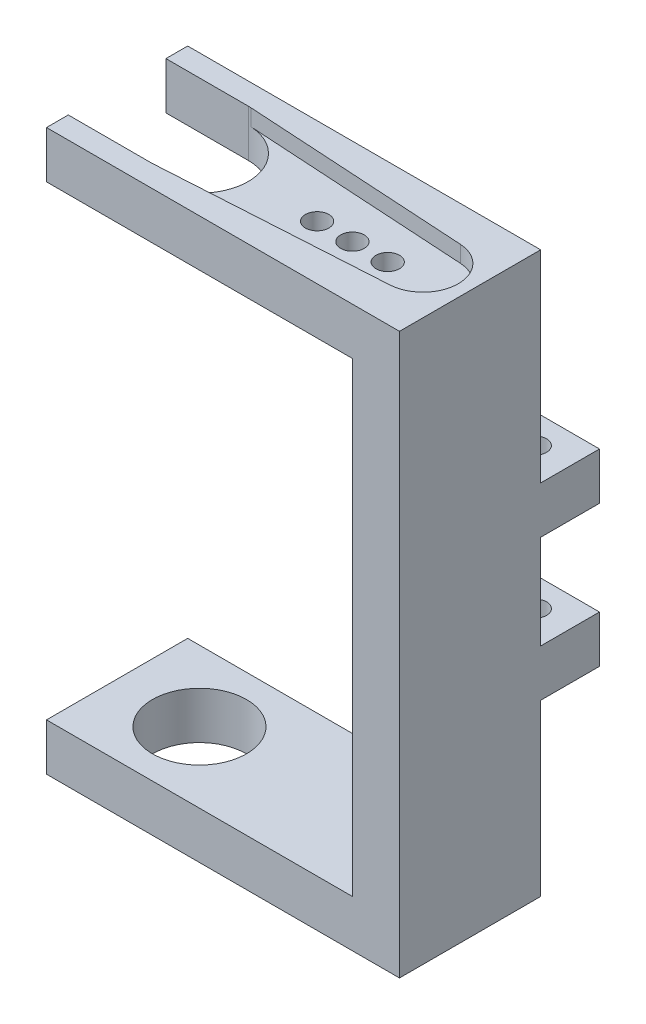
ISO-10303-21;
HEADER;
FILE_DESCRIPTION(('STEP AP214'),'2;1');
FILE_NAME('part.step','',(''),(''),'','','');
FILE_SCHEMA(('AUTOMOTIVE_DESIGN { 1 0 10303 214 1 1 1 1 }'));
ENDSEC;
DATA;
#1=APPLICATION_CONTEXT('core data for automotive mechanical design processes');
#2=APPLICATION_PROTOCOL_DEFINITION('international standard','automotive_design',2000,#1);
#3=PRODUCT_CONTEXT('',#1,'mechanical');
#4=PRODUCT('Part','Part','',(#3));
#5=PRODUCT_RELATED_PRODUCT_CATEGORY('part','',(#4));
#6=PRODUCT_DEFINITION_FORMATION('','',#4);
#7=PRODUCT_DEFINITION_CONTEXT('part definition',#1,'design');
#8=PRODUCT_DEFINITION('design','',#6,#7);
#9=PRODUCT_DEFINITION_SHAPE('','',#8);
#10=(LENGTH_UNIT() NAMED_UNIT(*) SI_UNIT(.MILLI.,.METRE.));
#11=(NAMED_UNIT(*) PLANE_ANGLE_UNIT() SI_UNIT($,.RADIAN.));
#12=(NAMED_UNIT(*) SI_UNIT($,.STERADIAN.) SOLID_ANGLE_UNIT());
#13=UNCERTAINTY_MEASURE_WITH_UNIT(LENGTH_MEASURE(1.E-05),#10,'distance_accuracy_value','');
#14=(GEOMETRIC_REPRESENTATION_CONTEXT(3) GLOBAL_UNCERTAINTY_ASSIGNED_CONTEXT((#13)) GLOBAL_UNIT_ASSIGNED_CONTEXT((#10,
#11,#12)) REPRESENTATION_CONTEXT('',''));
#15=CARTESIAN_POINT('',(0.,0.,0.));
#16=DIRECTION('',(0.,0.,1.));
#17=DIRECTION('',(1.,0.,0.));
#18=AXIS2_PLACEMENT_3D('',#15,#16,#17);
#19=CARTESIAN_POINT('',(0.,0.,0.));
#20=DIRECTION('',(0.,0.,1.));
#21=DIRECTION('',(1.,0.,0.));
#22=AXIS2_PLACEMENT_3D('',#19,#20,#21);
#23=PLANE('',#22);
#24=DIRECTION('',(-1.,0.,0.));
#25=VECTOR('',#24,1.);
#26=CARTESIAN_POINT('',(0.,10.44,0.));
#27=LINE('',#26,#25);
#28=CARTESIAN_POINT('',(30.,10.44,0.));
#29=VERTEX_POINT('',#28);
#30=CARTESIAN_POINT('',(26.,10.44,0.));
#31=VERTEX_POINT('',#30);
#32=EDGE_CURVE('E285',#29,#31,#27,.T.);
#33=ORIENTED_EDGE('',*,*,#32,.F.);
#34=DIRECTION('',(0.,1.,0.));
#35=VECTOR('',#34,1.);
#36=CARTESIAN_POINT('',(30.,-4.,0.));
#37=LINE('',#36,#35);
#38=CARTESIAN_POINT('',(30.,-4.,0.));
#39=VERTEX_POINT('',#38);
#40=EDGE_CURVE('E404',#39,#29,#37,.T.);
#41=ORIENTED_EDGE('',*,*,#40,.F.);
#42=DIRECTION('',(1.,0.,0.));
#43=VECTOR('',#42,1.);
#44=CARTESIAN_POINT('',(0.,-4.,0.));
#45=LINE('',#44,#43);
#46=CARTESIAN_POINT('',(0.,-4.,0.));
#47=VERTEX_POINT('',#46);
#48=EDGE_CURVE('E401',#47,#39,#45,.T.);
#49=ORIENTED_EDGE('',*,*,#48,.F.);
#50=DIRECTION('',(0.,-1.,0.));
#51=VECTOR('',#50,1.);
#52=CARTESIAN_POINT('',(0.,0.,0.));
#53=LINE('',#52,#51);
#54=CARTESIAN_POINT('',(0.,0.,0.));
#55=VERTEX_POINT('',#54);
#56=EDGE_CURVE('E377',#55,#47,#53,.T.);
#57=ORIENTED_EDGE('',*,*,#56,.F.);
#58=DIRECTION('',(-1.,0.,0.));
#59=VECTOR('',#58,1.);
#60=CARTESIAN_POINT('',(0.,0.,0.));
#61=LINE('',#60,#59);
#62=CARTESIAN_POINT('',(26.,0.,0.));
#63=VERTEX_POINT('',#62);
#64=EDGE_CURVE('E384',#63,#55,#61,.T.);
#65=ORIENTED_EDGE('',*,*,#64,.F.);
#66=DIRECTION('',(0.,-1.,0.));
#67=VECTOR('',#66,1.);
#68=CARTESIAN_POINT('',(26.,0.,0.));
#69=LINE('',#68,#67);
#70=EDGE_CURVE('E415',#31,#63,#69,.T.);
#71=ORIENTED_EDGE('',*,*,#70,.F.);
#72=EDGE_LOOP('',(#33,#41,#49,#57,#65,#71));
#73=FACE_BOUND('',#72,.T.);
#74=ADVANCED_FACE('F41',(#73),#23,.F.);
#75=DIRECTION('',(1.,0.,0.));
#76=VECTOR('',#75,1.);
#77=CARTESIAN_POINT('',(24.,26.44,0.));
#78=LINE('',#77,#76);
#79=CARTESIAN_POINT('',(26.,26.44,0.));
#80=VERTEX_POINT('',#79);
#81=CARTESIAN_POINT('',(30.,26.44,0.));
#82=VERTEX_POINT('',#81);
#83=EDGE_CURVE('E271',#80,#82,#78,.T.);
#84=ORIENTED_EDGE('',*,*,#83,.F.);
#85=CARTESIAN_POINT('',(26.,39.6,0.));
#86=VERTEX_POINT('',#85);
#87=EDGE_CURVE('E416',#86,#80,#69,.T.);
#88=ORIENTED_EDGE('',*,*,#87,.F.);
#89=DIRECTION('',(1.,0.,0.));
#90=VECTOR('',#89,1.);
#91=CARTESIAN_POINT('',(26.,39.6,0.));
#92=LINE('',#91,#90);
#93=CARTESIAN_POINT('',(0.,39.6,0.));
#94=VERTEX_POINT('',#93);
#95=EDGE_CURVE('E413',#94,#86,#92,.T.);
#96=ORIENTED_EDGE('',*,*,#95,.F.);
#97=DIRECTION('',(0.,-1.,0.));
#98=VECTOR('',#97,1.);
#99=CARTESIAN_POINT('',(0.,43.6,0.));
#100=LINE('',#99,#98);
#101=CARTESIAN_POINT('',(0.,43.6,0.));
#102=VERTEX_POINT('',#101);
#103=EDGE_CURVE('E410',#102,#94,#100,.T.);
#104=ORIENTED_EDGE('',*,*,#103,.F.);
#105=DIRECTION('',(-1.,0.,0.));
#106=VECTOR('',#105,1.);
#107=CARTESIAN_POINT('',(30.,43.6,0.));
#108=LINE('',#107,#106);
#109=CARTESIAN_POINT('',(30.,43.6,0.));
#110=VERTEX_POINT('',#109);
#111=EDGE_CURVE('E406',#110,#102,#108,.T.);
#112=ORIENTED_EDGE('',*,*,#111,.F.);
#113=EDGE_CURVE('E403',#82,#110,#37,.T.);
#114=ORIENTED_EDGE('',*,*,#113,.F.);
#115=EDGE_LOOP('',(#84,#88,#96,#104,#112,#114));
#116=FACE_BOUND('',#115,.T.);
#117=ADVANCED_FACE('F487',(#116),#23,.F.);
#118=CARTESIAN_POINT('',(30.,43.6,12.));
#119=DIRECTION('',(0.,-1.,0.));
#120=DIRECTION('',(0.,0.,-1.));
#121=AXIS2_PLACEMENT_3D('',#118,#119,#120);
#122=PLANE('',#121);
#123=CARTESIAN_POINT('',(26.,43.6,6.));
#124=DIRECTION('',(0.,1.,0.));
#125=DIRECTION('',(0.,0.,1.));
#126=AXIS2_PLACEMENT_3D('',#123,#124,#125);
#127=CIRCLE('',#126,3.);
#128=CARTESIAN_POINT('',(26.1815789473684,43.6,8.99449980562239));
#129=VERTEX_POINT('',#128);
#130=CARTESIAN_POINT('',(26.1815789473684,43.6,3.0055001943776));
#131=VERTEX_POINT('',#130);
#132=EDGE_CURVE('E333',#129,#131,#127,.T.);
#133=ORIENTED_EDGE('',*,*,#132,.F.);
#134=DIRECTION('',(0.998166601874133,0.,-0.0605263157894737));
#135=VECTOR('',#134,1.);
#136=CARTESIAN_POINT('',(0.639320336580883,43.6,10.5433182170481));
#137=LINE('',#136,#135);
#138=CARTESIAN_POINT('',(7.25118421052632,43.6,10.1423913977776));
#139=VERTEX_POINT('',#138);
#140=EDGE_CURVE('E317',#139,#129,#137,.T.);
#141=ORIENTED_EDGE('',*,*,#140,.F.);
#142=CARTESIAN_POINT('',(7.,43.6,6.));
#143=DIRECTION('',(0.,1.,0.));
#144=DIRECTION('',(0.,0.,1.));
#145=AXIS2_PLACEMENT_3D('',#142,#143,#144);
#146=CIRCLE('',#145,4.15);
#147=CARTESIAN_POINT('',(7.,43.6,10.15));
#148=VERTEX_POINT('',#147);
#149=EDGE_CURVE('E357',#148,#139,#146,.T.);
#150=ORIENTED_EDGE('',*,*,#149,.F.);
#151=DIRECTION('',(-1.,0.,0.));
#152=VECTOR('',#151,1.);
#153=CARTESIAN_POINT('',(0.,43.6,10.15));
#154=LINE('',#153,#152);
#155=CARTESIAN_POINT('',(0.,43.6,10.15));
#156=VERTEX_POINT('',#155);
#157=EDGE_CURVE('E351',#148,#156,#154,.T.);
#158=ORIENTED_EDGE('',*,*,#157,.T.);
#159=DIRECTION('',(0.,0.,-1.));
#160=VECTOR('',#159,1.);
#161=CARTESIAN_POINT('',(0.,43.6,12.));
#162=LINE('',#161,#160);
#163=CARTESIAN_POINT('',(0.,43.6,12.));
#164=VERTEX_POINT('',#163);
#165=EDGE_CURVE('E433',#164,#156,#162,.T.);
#166=ORIENTED_EDGE('',*,*,#165,.F.);
#167=DIRECTION('',(-1.,0.,0.));
#168=VECTOR('',#167,1.);
#169=CARTESIAN_POINT('',(30.,43.6,12.));
#170=LINE('',#169,#168);
#171=CARTESIAN_POINT('',(30.,43.6,12.));
#172=VERTEX_POINT('',#171);
#173=EDGE_CURVE('E388',#172,#164,#170,.T.);
#174=ORIENTED_EDGE('',*,*,#173,.F.);
#175=DIRECTION('',(0.,0.,-1.));
#176=VECTOR('',#175,1.);
#177=CARTESIAN_POINT('',(30.,43.6,12.));
#178=LINE('',#177,#176);
#179=EDGE_CURVE('E436',#172,#110,#178,.T.);
#180=ORIENTED_EDGE('',*,*,#179,.T.);
#181=ORIENTED_EDGE('',*,*,#111,.T.);
#182=CARTESIAN_POINT('',(0.,43.6,1.85));
#183=VERTEX_POINT('',#182);
#184=EDGE_CURVE('E432',#183,#102,#162,.T.);
#185=ORIENTED_EDGE('',*,*,#184,.F.);
#186=DIRECTION('',(-1.,0.,0.));
#187=VECTOR('',#186,1.);
#188=CARTESIAN_POINT('',(0.,43.6,1.85));
#189=LINE('',#188,#187);
#190=CARTESIAN_POINT('',(7.,43.6,1.85));
#191=VERTEX_POINT('',#190);
#192=EDGE_CURVE('E360',#191,#183,#189,.T.);
#193=ORIENTED_EDGE('',*,*,#192,.F.);
#194=CARTESIAN_POINT('',(7.25118421052632,43.6,1.85760860222235));
#195=VERTEX_POINT('',#194);
#196=EDGE_CURVE('E340',#195,#191,#146,.T.);
#197=ORIENTED_EDGE('',*,*,#196,.F.);
#198=DIRECTION('',(0.998166601874133,0.,0.0605263157894736));
#199=VECTOR('',#198,1.);
#200=CARTESIAN_POINT('',(-0.0856638268855922,43.6,1.41272056411529));
#201=LINE('',#200,#199);
#202=EDGE_CURVE('E322',#195,#131,#201,.T.);
#203=ORIENTED_EDGE('',*,*,#202,.T.);
#204=EDGE_LOOP('',(#133,#141,#150,#158,#166,#174,#180,#181,#185,#193,#197,#203));
#205=FACE_BOUND('',#204,.T.);
#206=ADVANCED_FACE('F532',(#205),#122,.F.);
#207=CARTESIAN_POINT('',(0.,43.6,12.));
#208=DIRECTION('',(1.,0.,0.));
#209=DIRECTION('',(0.,1.,0.));
#210=AXIS2_PLACEMENT_3D('',#207,#208,#209);
#211=PLANE('',#210);
#212=DIRECTION('',(0.,1.,0.));
#213=VECTOR('',#212,1.);
#214=CARTESIAN_POINT('',(0.,39.6,10.15));
#215=LINE('',#214,#213);
#216=CARTESIAN_POINT('',(0.,39.6,10.15));
#217=VERTEX_POINT('',#216);
#218=EDGE_CURVE('E367',#217,#156,#215,.T.);
#219=ORIENTED_EDGE('',*,*,#218,.F.);
#220=DIRECTION('',(0.,0.,-1.));
#221=VECTOR('',#220,1.);
#222=CARTESIAN_POINT('',(0.,39.6,12.));
#223=LINE('',#222,#221);
#224=CARTESIAN_POINT('',(0.,39.6,12.));
#225=VERTEX_POINT('',#224);
#226=EDGE_CURVE('E429',#225,#217,#223,.T.);
#227=ORIENTED_EDGE('',*,*,#226,.F.);
#228=DIRECTION('',(0.,-1.,0.));
#229=VECTOR('',#228,1.);
#230=CARTESIAN_POINT('',(0.,43.6,12.));
#231=LINE('',#230,#229);
#232=EDGE_CURVE('E390',#164,#225,#231,.T.);
#233=ORIENTED_EDGE('',*,*,#232,.F.);
#234=ORIENTED_EDGE('',*,*,#165,.T.);
#235=EDGE_LOOP('',(#219,#227,#233,#234));
#236=FACE_BOUND('',#235,.T.);
#237=ADVANCED_FACE('F540',(#236),#211,.F.);
#238=CARTESIAN_POINT('',(26.,39.6,12.));
#239=DIRECTION('',(0.,1.,0.));
#240=DIRECTION('',(0.,0.,1.));
#241=AXIS2_PLACEMENT_3D('',#238,#239,#240);
#242=PLANE('',#241);
#243=CARTESIAN_POINT('',(23.,39.6,6.));
#244=DIRECTION('',(0.,1.,0.));
#245=DIRECTION('',(0.,0.,1.));
#246=AXIS2_PLACEMENT_3D('',#243,#244,#245);
#247=CIRCLE('',#246,1.);
#248=CARTESIAN_POINT('',(23.,39.6,7.));
#249=VERTEX_POINT('',#248);
#250=EDGE_CURVE('E300',#249,#249,#247,.T.);
#251=ORIENTED_EDGE('',*,*,#250,.T.);
#252=EDGE_LOOP('',(#251));
#253=FACE_BOUND('',#252,.T.);
#254=CARTESIAN_POINT('',(20.,39.6,6.));
#255=DIRECTION('',(0.,1.,0.));
#256=DIRECTION('',(0.,0.,1.));
#257=AXIS2_PLACEMENT_3D('',#254,#255,#256);
#258=CIRCLE('',#257,1.);
#259=CARTESIAN_POINT('',(20.,39.6,7.));
#260=VERTEX_POINT('',#259);
#261=EDGE_CURVE('E304',#260,#260,#258,.T.);
#262=ORIENTED_EDGE('',*,*,#261,.T.);
#263=EDGE_LOOP('',(#262));
#264=FACE_BOUND('',#263,.T.);
#265=CARTESIAN_POINT('',(17.,39.6,6.));
#266=DIRECTION('',(0.,1.,0.));
#267=DIRECTION('',(0.,0.,1.));
#268=AXIS2_PLACEMENT_3D('',#265,#266,#267);
#269=CIRCLE('',#268,1.);
#270=CARTESIAN_POINT('',(17.,39.6,7.));
#271=VERTEX_POINT('',#270);
#272=EDGE_CURVE('E299',#271,#271,#269,.T.);
#273=ORIENTED_EDGE('',*,*,#272,.T.);
#274=EDGE_LOOP('',(#273));
#275=FACE_BOUND('',#274,.T.);
#276=DIRECTION('',(-1.,0.,0.));
#277=VECTOR('',#276,1.);
#278=CARTESIAN_POINT('',(0.,39.6,10.15));
#279=LINE('',#278,#277);
#280=CARTESIAN_POINT('',(7.,39.6,10.15));
#281=VERTEX_POINT('',#280);
#282=EDGE_CURVE('E354',#281,#217,#279,.T.);
#283=ORIENTED_EDGE('',*,*,#282,.F.);
#284=CARTESIAN_POINT('',(7.,39.6,6.));
#285=DIRECTION('',(0.,1.,0.));
#286=DIRECTION('',(0.,0.,1.));
#287=AXIS2_PLACEMENT_3D('',#284,#285,#286);
#288=CIRCLE('',#287,4.15);
#289=CARTESIAN_POINT('',(7.,39.6,1.85));
#290=VERTEX_POINT('',#289);
#291=EDGE_CURVE('E347',#281,#290,#288,.T.);
#292=ORIENTED_EDGE('',*,*,#291,.T.);
#293=DIRECTION('',(-1.,0.,0.));
#294=VECTOR('',#293,1.);
#295=CARTESIAN_POINT('',(0.,39.6,1.85));
#296=LINE('',#295,#294);
#297=CARTESIAN_POINT('',(0.,39.6,1.85));
#298=VERTEX_POINT('',#297);
#299=EDGE_CURVE('E350',#290,#298,#296,.T.);
#300=ORIENTED_EDGE('',*,*,#299,.T.);
#301=EDGE_CURVE('E428',#298,#94,#223,.T.);
#302=ORIENTED_EDGE('',*,*,#301,.T.);
#303=ORIENTED_EDGE('',*,*,#95,.T.);
#304=DIRECTION('',(0.,0.,-1.));
#305=VECTOR('',#304,1.);
#306=CARTESIAN_POINT('',(26.,39.6,12.));
#307=LINE('',#306,#305);
#308=CARTESIAN_POINT('',(26.,39.6,12.));
#309=VERTEX_POINT('',#308);
#310=EDGE_CURVE('E425',#309,#86,#307,.T.);
#311=ORIENTED_EDGE('',*,*,#310,.F.);
#312=DIRECTION('',(1.,0.,0.));
#313=VECTOR('',#312,1.);
#314=CARTESIAN_POINT('',(26.,39.6,12.));
#315=LINE('',#314,#313);
#316=EDGE_CURVE('E392',#225,#309,#315,.T.);
#317=ORIENTED_EDGE('',*,*,#316,.F.);
#318=ORIENTED_EDGE('',*,*,#226,.T.);
#319=EDGE_LOOP('',(#283,#292,#300,#302,#303,#311,#317,#318));
#320=FACE_BOUND('',#319,.T.);
#321=ADVANCED_FACE('F523',(#253,#264,#275,#320),#242,.F.);
#322=CARTESIAN_POINT('',(0.,0.,12.));
#323=DIRECTION('',(1.,0.,0.));
#324=DIRECTION('',(0.,0.,-1.));
#325=AXIS2_PLACEMENT_3D('',#322,#323,#324);
#326=PLANE('',#325);
#327=ORIENTED_EDGE('',*,*,#56,.T.);
#328=DIRECTION('',(0.,0.,-1.));
#329=VECTOR('',#328,1.);
#330=CARTESIAN_POINT('',(0.,-4.,12.));
#331=LINE('',#330,#329);
#332=CARTESIAN_POINT('',(0.,-4.,12.));
#333=VERTEX_POINT('',#332);
#334=EDGE_CURVE('E274',#333,#47,#331,.T.);
#335=ORIENTED_EDGE('',*,*,#334,.F.);
#336=DIRECTION('',(0.,-1.,0.));
#337=VECTOR('',#336,1.);
#338=CARTESIAN_POINT('',(0.,0.,12.));
#339=LINE('',#338,#337);
#340=CARTESIAN_POINT('',(0.,0.,12.));
#341=VERTEX_POINT('',#340);
#342=EDGE_CURVE('E380',#341,#333,#339,.T.);
#343=ORIENTED_EDGE('',*,*,#342,.F.);
#344=DIRECTION('',(0.,0.,-1.));
#345=VECTOR('',#344,1.);
#346=CARTESIAN_POINT('',(0.,0.,12.));
#347=LINE('',#346,#345);
#348=EDGE_CURVE('E398',#341,#55,#347,.T.);
#349=ORIENTED_EDGE('',*,*,#348,.T.);
#350=EDGE_LOOP('',(#327,#335,#343,#349));
#351=FACE_BOUND('',#350,.T.);
#352=ADVANCED_FACE('F513',(#351),#326,.F.);
#353=CARTESIAN_POINT('',(0.,-4.,12.));
#354=DIRECTION('',(0.,1.,0.));
#355=DIRECTION('',(0.,0.,1.));
#356=AXIS2_PLACEMENT_3D('',#353,#354,#355);
#357=PLANE('',#356);
#358=CARTESIAN_POINT('',(7.,-4.,6.));
#359=DIRECTION('',(0.,-1.,0.));
#360=DIRECTION('',(0.,0.,-1.));
#361=AXIS2_PLACEMENT_3D('',#358,#359,#360);
#362=CIRCLE('',#361,4.);
#363=CARTESIAN_POINT('',(7.,-4.,2.));
#364=VERTEX_POINT('',#363);
#365=EDGE_CURVE('E366',#364,#364,#362,.T.);
#366=ORIENTED_EDGE('',*,*,#365,.F.);
#367=EDGE_LOOP('',(#366));
#368=FACE_BOUND('',#367,.T.);
#369=ORIENTED_EDGE('',*,*,#48,.T.);
#370=DIRECTION('',(0.,0.,-1.));
#371=VECTOR('',#370,1.);
#372=CARTESIAN_POINT('',(30.,-4.,12.));
#373=LINE('',#372,#371);
#374=CARTESIAN_POINT('',(30.,-4.,12.));
#375=VERTEX_POINT('',#374);
#376=EDGE_CURVE('E439',#375,#39,#373,.T.);
#377=ORIENTED_EDGE('',*,*,#376,.F.);
#378=DIRECTION('',(1.,0.,0.));
#379=VECTOR('',#378,1.);
#380=CARTESIAN_POINT('',(0.,-4.,12.));
#381=LINE('',#380,#379);
#382=EDGE_CURVE('E383',#333,#375,#381,.T.);
#383=ORIENTED_EDGE('',*,*,#382,.F.);
#384=ORIENTED_EDGE('',*,*,#334,.T.);
#385=EDGE_LOOP('',(#369,#377,#383,#384));
#386=FACE_BOUND('',#385,.T.);
#387=ADVANCED_FACE('F685',(#368,#386),#357,.F.);
#388=CARTESIAN_POINT('',(30.,-4.,12.));
#389=DIRECTION('',(-1.,0.,0.));
#390=DIRECTION('',(0.,0.,1.));
#391=AXIS2_PLACEMENT_3D('',#388,#389,#390);
#392=PLANE('',#391);
#393=ORIENTED_EDGE('',*,*,#40,.T.);
#394=DIRECTION('',(0.,0.,-1.));
#395=VECTOR('',#394,1.);
#396=CARTESIAN_POINT('',(30.,10.44,0.));
#397=LINE('',#396,#395);
#398=CARTESIAN_POINT('',(30.,10.44,-5.));
#399=VERTEX_POINT('',#398);
#400=EDGE_CURVE('E241',#29,#399,#397,.T.);
#401=ORIENTED_EDGE('',*,*,#400,.T.);
#402=DIRECTION('',(0.,-1.,0.));
#403=VECTOR('',#402,1.);
#404=CARTESIAN_POINT('',(30.,14.44,-5.));
#405=LINE('',#404,#403);
#406=CARTESIAN_POINT('',(30.,14.44,-5.));
#407=VERTEX_POINT('',#406);
#408=EDGE_CURVE('E238',#407,#399,#405,.T.);
#409=ORIENTED_EDGE('',*,*,#408,.F.);
#410=DIRECTION('',(0.,0.,-1.));
#411=VECTOR('',#410,1.);
#412=CARTESIAN_POINT('',(30.,14.44,0.));
#413=LINE('',#412,#411);
#414=CARTESIAN_POINT('',(30.,14.44,0.));
#415=VERTEX_POINT('',#414);
#416=EDGE_CURVE('E224',#415,#407,#413,.T.);
#417=ORIENTED_EDGE('',*,*,#416,.F.);
#418=CARTESIAN_POINT('',(30.,22.44,0.));
#419=VERTEX_POINT('',#418);
#420=EDGE_CURVE('E407',#415,#419,#37,.T.);
#421=ORIENTED_EDGE('',*,*,#420,.T.);
#422=DIRECTION('',(0.,0.,-1.));
#423=VECTOR('',#422,1.);
#424=CARTESIAN_POINT('',(30.,22.44,0.));
#425=LINE('',#424,#423);
#426=CARTESIAN_POINT('',(30.,22.44,-5.));
#427=VERTEX_POINT('',#426);
#428=EDGE_CURVE('E268',#419,#427,#425,.T.);
#429=ORIENTED_EDGE('',*,*,#428,.T.);
#430=DIRECTION('',(0.,-1.,0.));
#431=VECTOR('',#430,1.);
#432=CARTESIAN_POINT('',(30.,26.44,-5.));
#433=LINE('',#432,#431);
#434=CARTESIAN_POINT('',(30.,26.44,-5.));
#435=VERTEX_POINT('',#434);
#436=EDGE_CURVE('E296',#435,#427,#433,.T.);
#437=ORIENTED_EDGE('',*,*,#436,.F.);
#438=DIRECTION('',(0.,0.,-1.));
#439=VECTOR('',#438,1.);
#440=CARTESIAN_POINT('',(30.,26.44,0.));
#441=LINE('',#440,#439);
#442=EDGE_CURVE('E275',#82,#435,#441,.T.);
#443=ORIENTED_EDGE('',*,*,#442,.F.);
#444=ORIENTED_EDGE('',*,*,#113,.T.);
#445=ORIENTED_EDGE('',*,*,#179,.F.);
#446=DIRECTION('',(0.,1.,0.));
#447=VECTOR('',#446,1.);
#448=CARTESIAN_POINT('',(30.,-4.,12.));
#449=LINE('',#448,#447);
#450=EDGE_CURVE('E386',#375,#172,#449,.T.);
#451=ORIENTED_EDGE('',*,*,#450,.F.);
#452=ORIENTED_EDGE('',*,*,#376,.T.);
#453=EDGE_LOOP('',(#393,#401,#409,#417,#421,#429,#437,#443,#444,#445,#451,#452));
#454=FACE_BOUND('',#453,.T.);
#455=ADVANCED_FACE('F240',(#454),#392,.F.);
#456=ORIENTED_EDGE('',*,*,#301,.F.);
#457=DIRECTION('',(0.,1.,0.));
#458=VECTOR('',#457,1.);
#459=CARTESIAN_POINT('',(0.,39.6,1.85));
#460=LINE('',#459,#458);
#461=EDGE_CURVE('E369',#298,#183,#460,.T.);
#462=ORIENTED_EDGE('',*,*,#461,.T.);
#463=ORIENTED_EDGE('',*,*,#184,.T.);
#464=ORIENTED_EDGE('',*,*,#103,.T.);
#465=EDGE_LOOP('',(#456,#462,#463,#464));
#466=FACE_BOUND('',#465,.T.);
#467=ADVANCED_FACE('F527',(#466),#211,.F.);
#468=CARTESIAN_POINT('',(26.,0.,12.));
#469=DIRECTION('',(1.,0.,0.));
#470=DIRECTION('',(0.,0.,-1.));
#471=AXIS2_PLACEMENT_3D('',#468,#469,#470);
#472=PLANE('',#471);
#473=DIRECTION('',(0.,-1.,0.));
#474=VECTOR('',#473,1.);
#475=CARTESIAN_POINT('',(26.,10.44,2.));
#476=LINE('',#475,#474);
#477=CARTESIAN_POINT('',(26.,14.44,2.));
#478=VERTEX_POINT('',#477);
#479=CARTESIAN_POINT('',(26.,10.44,2.));
#480=VERTEX_POINT('',#479);
#481=EDGE_CURVE('E454',#478,#480,#476,.T.);
#482=ORIENTED_EDGE('',*,*,#481,.T.);
#483=DIRECTION('',(0.,0.,-1.));
#484=VECTOR('',#483,1.);
#485=CARTESIAN_POINT('',(26.,10.44,0.));
#486=LINE('',#485,#484);
#487=EDGE_CURVE('E457',#480,#31,#486,.T.);
#488=ORIENTED_EDGE('',*,*,#487,.T.);
#489=ORIENTED_EDGE('',*,*,#70,.T.);
#490=DIRECTION('',(0.,0.,-1.));
#491=VECTOR('',#490,1.);
#492=CARTESIAN_POINT('',(26.,0.,12.));
#493=LINE('',#492,#491);
#494=CARTESIAN_POINT('',(26.,0.,12.));
#495=VERTEX_POINT('',#494);
#496=EDGE_CURVE('E422',#495,#63,#493,.T.);
#497=ORIENTED_EDGE('',*,*,#496,.F.);
#498=DIRECTION('',(0.,-1.,0.));
#499=VECTOR('',#498,1.);
#500=CARTESIAN_POINT('',(26.,0.,12.));
#501=LINE('',#500,#499);
#502=EDGE_CURVE('E394',#309,#495,#501,.T.);
#503=ORIENTED_EDGE('',*,*,#502,.F.);
#504=ORIENTED_EDGE('',*,*,#310,.T.);
#505=ORIENTED_EDGE('',*,*,#87,.T.);
#506=DIRECTION('',(0.,0.,1.));
#507=VECTOR('',#506,1.);
#508=CARTESIAN_POINT('',(26.,26.44,12.));
#509=LINE('',#508,#507);
#510=CARTESIAN_POINT('',(26.,26.44,2.));
#511=VERTEX_POINT('',#510);
#512=EDGE_CURVE('E55',#80,#511,#509,.T.);
#513=ORIENTED_EDGE('',*,*,#512,.T.);
#514=DIRECTION('',(0.,-1.,0.));
#515=VECTOR('',#514,1.);
#516=CARTESIAN_POINT('',(26.,22.44,2.));
#517=LINE('',#516,#515);
#518=CARTESIAN_POINT('',(26.,22.44,2.));
#519=VERTEX_POINT('',#518);
#520=EDGE_CURVE('E448',#511,#519,#517,.T.);
#521=ORIENTED_EDGE('',*,*,#520,.T.);
#522=DIRECTION('',(0.,0.,-1.));
#523=VECTOR('',#522,1.);
#524=CARTESIAN_POINT('',(26.,22.44,0.));
#525=LINE('',#524,#523);
#526=CARTESIAN_POINT('',(26.,22.44,0.));
#527=VERTEX_POINT('',#526);
#528=EDGE_CURVE('E451',#519,#527,#525,.T.);
#529=ORIENTED_EDGE('',*,*,#528,.T.);
#530=CARTESIAN_POINT('',(26.,14.44,0.));
#531=VERTEX_POINT('',#530);
#532=EDGE_CURVE('E418',#527,#531,#69,.T.);
#533=ORIENTED_EDGE('',*,*,#532,.T.);
#534=DIRECTION('',(0.,0.,1.));
#535=VECTOR('',#534,1.);
#536=CARTESIAN_POINT('',(26.,14.44,12.));
#537=LINE('',#536,#535);
#538=EDGE_CURVE('E63',#531,#478,#537,.T.);
#539=ORIENTED_EDGE('',*,*,#538,.T.);
#540=EDGE_LOOP('',(#482,#488,#489,#497,#503,#504,#505,#513,#521,#529,#533,#539));
#541=FACE_BOUND('',#540,.T.);
#542=ADVANCED_FACE('F480',(#541),#472,.F.);
#543=CARTESIAN_POINT('',(0.,0.,12.));
#544=DIRECTION('',(0.,-1.,0.));
#545=DIRECTION('',(0.,0.,-1.));
#546=AXIS2_PLACEMENT_3D('',#543,#544,#545);
#547=PLANE('',#546);
#548=CARTESIAN_POINT('',(7.,0.,6.));
#549=DIRECTION('',(0.,-1.,0.));
#550=DIRECTION('',(0.,0.,-1.));
#551=AXIS2_PLACEMENT_3D('',#548,#549,#550);
#552=CIRCLE('',#551,4.);
#553=CARTESIAN_POINT('',(7.,0.,2.));
#554=VERTEX_POINT('',#553);
#555=EDGE_CURVE('E374',#554,#554,#552,.T.);
#556=ORIENTED_EDGE('',*,*,#555,.T.);
#557=EDGE_LOOP('',(#556));
#558=FACE_BOUND('',#557,.T.);
#559=ORIENTED_EDGE('',*,*,#64,.T.);
#560=ORIENTED_EDGE('',*,*,#348,.F.);
#561=DIRECTION('',(-1.,0.,0.));
#562=VECTOR('',#561,1.);
#563=CARTESIAN_POINT('',(0.,0.,12.));
#564=LINE('',#563,#562);
#565=EDGE_CURVE('E396',#495,#341,#564,.T.);
#566=ORIENTED_EDGE('',*,*,#565,.F.);
#567=ORIENTED_EDGE('',*,*,#496,.T.);
#568=EDGE_LOOP('',(#559,#560,#566,#567));
#569=FACE_BOUND('',#568,.T.);
#570=ADVANCED_FACE('F507',(#558,#569),#547,.F.);
#571=CARTESIAN_POINT('',(0.,0.,12.));
#572=DIRECTION('',(0.,0.,1.));
#573=DIRECTION('',(1.,0.,0.));
#574=AXIS2_PLACEMENT_3D('',#571,#572,#573);
#575=PLANE('',#574);
#576=ORIENTED_EDGE('',*,*,#342,.T.);
#577=ORIENTED_EDGE('',*,*,#382,.T.);
#578=ORIENTED_EDGE('',*,*,#450,.T.);
#579=ORIENTED_EDGE('',*,*,#173,.T.);
#580=ORIENTED_EDGE('',*,*,#232,.T.);
#581=ORIENTED_EDGE('',*,*,#316,.T.);
#582=ORIENTED_EDGE('',*,*,#502,.T.);
#583=ORIENTED_EDGE('',*,*,#565,.T.);
#584=EDGE_LOOP('',(#576,#577,#578,#579,#580,#581,#582,#583));
#585=FACE_BOUND('',#584,.T.);
#586=ADVANCED_FACE('F516',(#585),#575,.T.);
#587=ORIENTED_EDGE('',*,*,#420,.F.);
#588=DIRECTION('',(-1.,0.,0.));
#589=VECTOR('',#588,1.);
#590=CARTESIAN_POINT('',(0.,14.44,0.));
#591=LINE('',#590,#589);
#592=EDGE_CURVE('E232',#415,#531,#591,.T.);
#593=ORIENTED_EDGE('',*,*,#592,.T.);
#594=ORIENTED_EDGE('',*,*,#532,.F.);
#595=DIRECTION('',(1.,0.,0.));
#596=VECTOR('',#595,1.);
#597=CARTESIAN_POINT('',(24.,22.44,0.));
#598=LINE('',#597,#596);
#599=EDGE_CURVE('E273',#527,#419,#598,.T.);
#600=ORIENTED_EDGE('',*,*,#599,.T.);
#601=EDGE_LOOP('',(#587,#593,#594,#600));
#602=FACE_BOUND('',#601,.T.);
#603=ADVANCED_FACE('F498',(#602),#23,.F.);
#604=CARTESIAN_POINT('',(7.,0.,6.));
#605=DIRECTION('',(0.,-1.,0.));
#606=DIRECTION('',(0.,0.,-1.));
#607=AXIS2_PLACEMENT_3D('',#604,#605,#606);
#608=CYLINDRICAL_SURFACE('',#607,4.);
#609=ORIENTED_EDGE('',*,*,#555,.F.);
#610=EDGE_LOOP('',(#609));
#611=FACE_BOUND('',#610,.T.);
#612=ORIENTED_EDGE('',*,*,#365,.T.);
#613=EDGE_LOOP('',(#612));
#614=FACE_BOUND('',#613,.T.);
#615=ADVANCED_FACE('F586',(#611,#614),#608,.F.);
#616=CARTESIAN_POINT('',(7.,39.6,6.));
#617=DIRECTION('',(0.,1.,0.));
#618=DIRECTION('',(0.,0.,1.));
#619=AXIS2_PLACEMENT_3D('',#616,#617,#618);
#620=CYLINDRICAL_SURFACE('',#619,4.15);
#621=ORIENTED_EDGE('',*,*,#149,.T.);
#622=DIRECTION('',(0.,1.,0.));
#623=VECTOR('',#622,1.);
#624=CARTESIAN_POINT('',(7.25118421052632,42.2,10.1423913977776));
#625=LINE('',#624,#623);
#626=CARTESIAN_POINT('',(7.25118421052632,42.2,10.1423913977776));
#627=VERTEX_POINT('',#626);
#628=EDGE_CURVE('E338',#627,#139,#625,.T.);
#629=ORIENTED_EDGE('',*,*,#628,.F.);
#630=CARTESIAN_POINT('',(7.,42.2,6.));
#631=DIRECTION('',(0.,1.,0.));
#632=DIRECTION('',(0.,0.,1.));
#633=AXIS2_PLACEMENT_3D('',#630,#631,#632);
#634=CIRCLE('',#633,4.15);
#635=CARTESIAN_POINT('',(7.25118421052632,42.2,1.85760860222235));
#636=VERTEX_POINT('',#635);
#637=EDGE_CURVE('E327',#636,#627,#634,.F.);
#638=ORIENTED_EDGE('',*,*,#637,.F.);
#639=DIRECTION('',(0.,1.,0.));
#640=VECTOR('',#639,1.);
#641=CARTESIAN_POINT('',(7.25118421052632,42.2,1.85760860222235));
#642=LINE('',#641,#640);
#643=EDGE_CURVE('E341',#636,#195,#642,.T.);
#644=ORIENTED_EDGE('',*,*,#643,.T.);
#645=ORIENTED_EDGE('',*,*,#196,.T.);
#646=DIRECTION('',(0.,1.,0.));
#647=VECTOR('',#646,1.);
#648=CARTESIAN_POINT('',(7.,39.6,1.85));
#649=LINE('',#648,#647);
#650=EDGE_CURVE('E356',#290,#191,#649,.T.);
#651=ORIENTED_EDGE('',*,*,#650,.F.);
#652=ORIENTED_EDGE('',*,*,#291,.F.);
#653=DIRECTION('',(0.,1.,0.));
#654=VECTOR('',#653,1.);
#655=CARTESIAN_POINT('',(7.,39.6,10.15));
#656=LINE('',#655,#654);
#657=EDGE_CURVE('E364',#281,#148,#656,.T.);
#658=ORIENTED_EDGE('',*,*,#657,.T.);
#659=EDGE_LOOP('',(#621,#629,#638,#644,#645,#651,#652,#658));
#660=FACE_BOUND('',#659,.T.);
#661=ADVANCED_FACE('F545',(#660),#620,.F.);
#662=CARTESIAN_POINT('',(0.,39.6,10.15));
#663=DIRECTION('',(0.,0.,-1.));
#664=DIRECTION('',(-1.,0.,0.));
#665=AXIS2_PLACEMENT_3D('',#662,#663,#664);
#666=PLANE('',#665);
#667=ORIENTED_EDGE('',*,*,#157,.F.);
#668=ORIENTED_EDGE('',*,*,#657,.F.);
#669=ORIENTED_EDGE('',*,*,#282,.T.);
#670=ORIENTED_EDGE('',*,*,#218,.T.);
#671=EDGE_LOOP('',(#667,#668,#669,#670));
#672=FACE_BOUND('',#671,.T.);
#673=ADVANCED_FACE('F543',(#672),#666,.T.);
#674=CARTESIAN_POINT('',(0.,39.6,1.85));
#675=DIRECTION('',(0.,0.,-1.));
#676=DIRECTION('',(-1.,0.,0.));
#677=AXIS2_PLACEMENT_3D('',#674,#675,#676);
#678=PLANE('',#677);
#679=ORIENTED_EDGE('',*,*,#192,.T.);
#680=ORIENTED_EDGE('',*,*,#461,.F.);
#681=ORIENTED_EDGE('',*,*,#299,.F.);
#682=ORIENTED_EDGE('',*,*,#650,.T.);
#683=EDGE_LOOP('',(#679,#680,#681,#682));
#684=FACE_BOUND('',#683,.T.);
#685=ADVANCED_FACE('F549',(#684),#678,.F.);
#686=CARTESIAN_POINT('',(0.639320336580883,42.2,10.5433182170481));
#687=DIRECTION('',(0.0605263157894737,0.,0.998166601874133));
#688=DIRECTION('',(0.998166601874133,0.,-0.0605263157894737));
#689=AXIS2_PLACEMENT_3D('',#686,#687,#688);
#690=PLANE('',#689);
#691=ORIENTED_EDGE('',*,*,#140,.T.);
#692=DIRECTION('',(0.,1.,0.));
#693=VECTOR('',#692,1.);
#694=CARTESIAN_POINT('',(26.1815789473684,42.2,8.99449980562239));
#695=LINE('',#694,#693);
#696=CARTESIAN_POINT('',(26.1815789473684,42.2,8.99449980562239));
#697=VERTEX_POINT('',#696);
#698=EDGE_CURVE('E330',#697,#129,#695,.T.);
#699=ORIENTED_EDGE('',*,*,#698,.F.);
#700=DIRECTION('',(0.998166601874133,0.,-0.0605263157894737));
#701=VECTOR('',#700,1.);
#702=CARTESIAN_POINT('',(0.639320336580883,42.2,10.5433182170481));
#703=LINE('',#702,#701);
#704=EDGE_CURVE('E318',#627,#697,#703,.T.);
#705=ORIENTED_EDGE('',*,*,#704,.F.);
#706=ORIENTED_EDGE('',*,*,#628,.T.);
#707=EDGE_LOOP('',(#691,#699,#705,#706));
#708=FACE_BOUND('',#707,.T.);
#709=ADVANCED_FACE('F564',(#708),#690,.F.);
#710=CARTESIAN_POINT('',(-0.0856638268855922,42.2,1.41272056411529));
#711=DIRECTION('',(-0.0605263157894736,0.,0.998166601874133));
#712=DIRECTION('',(0.998166601874133,0.,0.0605263157894736));
#713=AXIS2_PLACEMENT_3D('',#710,#711,#712);
#714=PLANE('',#713);
#715=ORIENTED_EDGE('',*,*,#202,.F.);
#716=ORIENTED_EDGE('',*,*,#643,.F.);
#717=DIRECTION('',(0.998166601874133,0.,0.0605263157894736));
#718=VECTOR('',#717,1.);
#719=CARTESIAN_POINT('',(-0.0856638268855922,42.2,1.41272056411529));
#720=LINE('',#719,#718);
#721=CARTESIAN_POINT('',(26.1815789473684,42.2,3.0055001943776));
#722=VERTEX_POINT('',#721);
#723=EDGE_CURVE('E325',#636,#722,#720,.T.);
#724=ORIENTED_EDGE('',*,*,#723,.T.);
#725=DIRECTION('',(0.,1.,0.));
#726=VECTOR('',#725,1.);
#727=CARTESIAN_POINT('',(26.1815789473684,42.2,3.0055001943776));
#728=LINE('',#727,#726);
#729=EDGE_CURVE('E344',#722,#131,#728,.T.);
#730=ORIENTED_EDGE('',*,*,#729,.T.);
#731=EDGE_LOOP('',(#715,#716,#724,#730));
#732=FACE_BOUND('',#731,.T.);
#733=ADVANCED_FACE('F553',(#732),#714,.T.);
#734=CARTESIAN_POINT('',(26.,42.2,6.));
#735=DIRECTION('',(0.,1.,0.));
#736=DIRECTION('',(0.,0.,1.));
#737=AXIS2_PLACEMENT_3D('',#734,#735,#736);
#738=CYLINDRICAL_SURFACE('',#737,3.);
#739=ORIENTED_EDGE('',*,*,#132,.T.);
#740=ORIENTED_EDGE('',*,*,#729,.F.);
#741=CARTESIAN_POINT('',(26.,42.2,6.));
#742=DIRECTION('',(0.,1.,0.));
#743=DIRECTION('',(0.,0.,1.));
#744=AXIS2_PLACEMENT_3D('',#741,#742,#743);
#745=CIRCLE('',#744,3.);
#746=EDGE_CURVE('E321',#697,#722,#745,.T.);
#747=ORIENTED_EDGE('',*,*,#746,.F.);
#748=ORIENTED_EDGE('',*,*,#698,.T.);
#749=EDGE_LOOP('',(#739,#740,#747,#748));
#750=FACE_BOUND('',#749,.T.);
#751=ADVANCED_FACE('F562',(#750),#738,.F.);
#752=CARTESIAN_POINT('',(0.,42.2,0.));
#753=DIRECTION('',(0.,1.,0.));
#754=DIRECTION('',(0.,0.,1.));
#755=AXIS2_PLACEMENT_3D('',#752,#753,#754);
#756=PLANE('',#755);
#757=ORIENTED_EDGE('',*,*,#704,.T.);
#758=ORIENTED_EDGE('',*,*,#746,.T.);
#759=ORIENTED_EDGE('',*,*,#723,.F.);
#760=ORIENTED_EDGE('',*,*,#637,.T.);
#761=EDGE_LOOP('',(#757,#758,#759,#760));
#762=FACE_BOUND('',#761,.T.);
#763=CARTESIAN_POINT('',(17.,42.2,6.));
#764=DIRECTION('',(0.,1.,0.));
#765=DIRECTION('',(0.,0.,1.));
#766=AXIS2_PLACEMENT_3D('',#763,#764,#765);
#767=CIRCLE('',#766,1.);
#768=CARTESIAN_POINT('',(17.,42.2,7.));
#769=VERTEX_POINT('',#768);
#770=EDGE_CURVE('E311',#769,#769,#767,.T.);
#771=ORIENTED_EDGE('',*,*,#770,.F.);
#772=EDGE_LOOP('',(#771));
#773=FACE_BOUND('',#772,.T.);
#774=CARTESIAN_POINT('',(20.,42.2,6.));
#775=DIRECTION('',(0.,1.,0.));
#776=DIRECTION('',(0.,0.,1.));
#777=AXIS2_PLACEMENT_3D('',#774,#775,#776);
#778=CIRCLE('',#777,1.);
#779=CARTESIAN_POINT('',(20.,42.2,7.));
#780=VERTEX_POINT('',#779);
#781=EDGE_CURVE('E303',#780,#780,#778,.T.);
#782=ORIENTED_EDGE('',*,*,#781,.F.);
#783=EDGE_LOOP('',(#782));
#784=FACE_BOUND('',#783,.T.);
#785=CARTESIAN_POINT('',(23.,42.2,6.));
#786=DIRECTION('',(0.,1.,0.));
#787=DIRECTION('',(0.,0.,1.));
#788=AXIS2_PLACEMENT_3D('',#785,#786,#787);
#789=CIRCLE('',#788,1.);
#790=CARTESIAN_POINT('',(23.,42.2,7.));
#791=VERTEX_POINT('',#790);
#792=EDGE_CURVE('E314',#791,#791,#789,.T.);
#793=ORIENTED_EDGE('',*,*,#792,.F.);
#794=EDGE_LOOP('',(#793));
#795=FACE_BOUND('',#794,.T.);
#796=ADVANCED_FACE('F558',(#762,#773,#784,#795),#756,.T.);
#797=CARTESIAN_POINT('',(17.,39.6,6.));
#798=DIRECTION('',(0.,1.,0.));
#799=DIRECTION('',(0.,0.,1.));
#800=AXIS2_PLACEMENT_3D('',#797,#798,#799);
#801=CYLINDRICAL_SURFACE('',#800,1.);
#802=ORIENTED_EDGE('',*,*,#770,.T.);
#803=EDGE_LOOP('',(#802));
#804=FACE_BOUND('',#803,.T.);
#805=ORIENTED_EDGE('',*,*,#272,.F.);
#806=EDGE_LOOP('',(#805));
#807=FACE_BOUND('',#806,.T.);
#808=ADVANCED_FACE('F759',(#804,#807),#801,.F.);
#809=CARTESIAN_POINT('',(20.,39.6,6.));
#810=DIRECTION('',(0.,1.,0.));
#811=DIRECTION('',(0.,0.,1.));
#812=AXIS2_PLACEMENT_3D('',#809,#810,#811);
#813=CYLINDRICAL_SURFACE('',#812,1.);
#814=ORIENTED_EDGE('',*,*,#781,.T.);
#815=EDGE_LOOP('',(#814));
#816=FACE_BOUND('',#815,.T.);
#817=ORIENTED_EDGE('',*,*,#261,.F.);
#818=EDGE_LOOP('',(#817));
#819=FACE_BOUND('',#818,.T.);
#820=ADVANCED_FACE('F755',(#816,#819),#813,.F.);
#821=CARTESIAN_POINT('',(23.,39.6,6.));
#822=DIRECTION('',(0.,1.,0.));
#823=DIRECTION('',(0.,0.,1.));
#824=AXIS2_PLACEMENT_3D('',#821,#822,#823);
#825=CYLINDRICAL_SURFACE('',#824,1.);
#826=ORIENTED_EDGE('',*,*,#792,.T.);
#827=EDGE_LOOP('',(#826));
#828=FACE_BOUND('',#827,.T.);
#829=ORIENTED_EDGE('',*,*,#250,.F.);
#830=EDGE_LOOP('',(#829));
#831=FACE_BOUND('',#830,.T.);
#832=ADVANCED_FACE('F747',(#828,#831),#825,.F.);
#833=CARTESIAN_POINT('',(0.,26.44,0.));
#834=DIRECTION('',(0.,1.,0.));
#835=DIRECTION('',(0.,0.,1.));
#836=AXIS2_PLACEMENT_3D('',#833,#834,#835);
#837=PLANE('',#836);
#838=DIRECTION('',(0.,0.,1.));
#839=VECTOR('',#838,1.);
#840=CARTESIAN_POINT('',(24.,26.44,-5.));
#841=LINE('',#840,#839);
#842=CARTESIAN_POINT('',(24.,26.44,-5.));
#843=VERTEX_POINT('',#842);
#844=CARTESIAN_POINT('',(24.,26.44,0.));
#845=VERTEX_POINT('',#844);
#846=EDGE_CURVE('E280',#843,#845,#841,.T.);
#847=ORIENTED_EDGE('',*,*,#846,.T.);
#848=CARTESIAN_POINT('',(24.,26.44,2.));
#849=DIRECTION('',(0.,1.,0.));
#850=DIRECTION('',(0.,0.,1.));
#851=AXIS2_PLACEMENT_3D('',#848,#849,#850);
#852=CIRCLE('',#851,2.);
#853=EDGE_CURVE('E11',#845,#511,#852,.F.);
#854=ORIENTED_EDGE('',*,*,#853,.T.);
#855=ORIENTED_EDGE('',*,*,#512,.F.);
#856=ORIENTED_EDGE('',*,*,#83,.T.);
#857=ORIENTED_EDGE('',*,*,#442,.T.);
#858=DIRECTION('',(-1.,0.,0.));
#859=VECTOR('',#858,1.);
#860=CARTESIAN_POINT('',(30.,26.44,-5.));
#861=LINE('',#860,#859);
#862=EDGE_CURVE('E277',#435,#843,#861,.T.);
#863=ORIENTED_EDGE('',*,*,#862,.T.);
#864=EDGE_LOOP('',(#847,#854,#855,#856,#857,#863));
#865=FACE_BOUND('',#864,.T.);
#866=CARTESIAN_POINT('',(27.,26.44,-2.5));
#867=DIRECTION('',(0.,1.,0.));
#868=DIRECTION('',(0.,0.,1.));
#869=AXIS2_PLACEMENT_3D('',#866,#867,#868);
#870=CIRCLE('',#869,1.);
#871=CARTESIAN_POINT('',(27.,26.44,-1.5));
#872=VERTEX_POINT('',#871);
#873=EDGE_CURVE('E265',#872,#872,#870,.T.);
#874=ORIENTED_EDGE('',*,*,#873,.F.);
#875=EDGE_LOOP('',(#874));
#876=FACE_BOUND('',#875,.T.);
#877=ADVANCED_FACE('F477',(#865,#876),#837,.T.);
#878=CARTESIAN_POINT('',(0.,22.44,0.));
#879=DIRECTION('',(0.,1.,0.));
#880=DIRECTION('',(0.,0.,1.));
#881=AXIS2_PLACEMENT_3D('',#878,#879,#880);
#882=PLANE('',#881);
#883=ORIENTED_EDGE('',*,*,#599,.F.);
#884=ORIENTED_EDGE('',*,*,#528,.F.);
#885=CARTESIAN_POINT('',(24.,22.44,2.));
#886=DIRECTION('',(0.,1.,0.));
#887=DIRECTION('',(0.,0.,1.));
#888=AXIS2_PLACEMENT_3D('',#885,#886,#887);
#889=CIRCLE('',#888,2.);
#890=CARTESIAN_POINT('',(24.,22.44,0.));
#891=VERTEX_POINT('',#890);
#892=EDGE_CURVE('E49',#519,#891,#889,.T.);
#893=ORIENTED_EDGE('',*,*,#892,.T.);
#894=DIRECTION('',(0.,0.,1.));
#895=VECTOR('',#894,1.);
#896=CARTESIAN_POINT('',(24.,22.44,-5.));
#897=LINE('',#896,#895);
#898=CARTESIAN_POINT('',(24.,22.44,-5.));
#899=VERTEX_POINT('',#898);
#900=EDGE_CURVE('E278',#899,#891,#897,.T.);
#901=ORIENTED_EDGE('',*,*,#900,.F.);
#902=DIRECTION('',(-1.,0.,0.));
#903=VECTOR('',#902,1.);
#904=CARTESIAN_POINT('',(30.,22.44,-5.));
#905=LINE('',#904,#903);
#906=EDGE_CURVE('E287',#427,#899,#905,.T.);
#907=ORIENTED_EDGE('',*,*,#906,.F.);
#908=ORIENTED_EDGE('',*,*,#428,.F.);
#909=EDGE_LOOP('',(#883,#884,#893,#901,#907,#908));
#910=FACE_BOUND('',#909,.T.);
#911=CARTESIAN_POINT('',(27.,22.44,-2.5));
#912=DIRECTION('',(0.,1.,0.));
#913=DIRECTION('',(0.,0.,1.));
#914=AXIS2_PLACEMENT_3D('',#911,#912,#913);
#915=CIRCLE('',#914,1.);
#916=CARTESIAN_POINT('',(27.,22.44,-1.5));
#917=VERTEX_POINT('',#916);
#918=EDGE_CURVE('E244',#917,#917,#915,.T.);
#919=ORIENTED_EDGE('',*,*,#918,.T.);
#920=EDGE_LOOP('',(#919));
#921=FACE_BOUND('',#920,.T.);
#922=ADVANCED_FACE('F466',(#910,#921),#882,.F.);
#923=CARTESIAN_POINT('',(30.,26.44,-5.));
#924=DIRECTION('',(0.,0.,1.));
#925=DIRECTION('',(1.,0.,0.));
#926=AXIS2_PLACEMENT_3D('',#923,#924,#925);
#927=PLANE('',#926);
#928=ORIENTED_EDGE('',*,*,#906,.T.);
#929=DIRECTION('',(0.,-1.,0.));
#930=VECTOR('',#929,1.);
#931=CARTESIAN_POINT('',(24.,26.44,-5.));
#932=LINE('',#931,#930);
#933=EDGE_CURVE('E293',#843,#899,#932,.T.);
#934=ORIENTED_EDGE('',*,*,#933,.F.);
#935=ORIENTED_EDGE('',*,*,#862,.F.);
#936=ORIENTED_EDGE('',*,*,#436,.T.);
#937=EDGE_LOOP('',(#928,#934,#935,#936));
#938=FACE_BOUND('',#937,.T.);
#939=ADVANCED_FACE('F495',(#938),#927,.F.);
#940=CARTESIAN_POINT('',(24.,26.44,-5.));
#941=DIRECTION('',(1.,0.,0.));
#942=DIRECTION('',(0.,0.,-1.));
#943=AXIS2_PLACEMENT_3D('',#940,#941,#942);
#944=PLANE('',#943);
#945=ORIENTED_EDGE('',*,*,#900,.T.);
#946=DIRECTION('',(0.,-1.,0.));
#947=VECTOR('',#946,1.);
#948=CARTESIAN_POINT('',(24.,26.44,0.));
#949=LINE('',#948,#947);
#950=EDGE_CURVE('E282',#845,#891,#949,.T.);
#951=ORIENTED_EDGE('',*,*,#950,.F.);
#952=ORIENTED_EDGE('',*,*,#846,.F.);
#953=ORIENTED_EDGE('',*,*,#933,.T.);
#954=EDGE_LOOP('',(#945,#951,#952,#953));
#955=FACE_BOUND('',#954,.T.);
#956=ADVANCED_FACE('F473',(#955),#944,.F.);
#957=CARTESIAN_POINT('',(27.,26.44,-2.5));
#958=DIRECTION('',(0.,-1.,0.));
#959=DIRECTION('',(0.,0.,-1.));
#960=AXIS2_PLACEMENT_3D('',#957,#958,#959);
#961=CYLINDRICAL_SURFACE('',#960,1.);
#962=ORIENTED_EDGE('',*,*,#873,.T.);
#963=EDGE_LOOP('',(#962));
#964=FACE_BOUND('',#963,.T.);
#965=ORIENTED_EDGE('',*,*,#918,.F.);
#966=EDGE_LOOP('',(#965));
#967=FACE_BOUND('',#966,.T.);
#968=ADVANCED_FACE('F736',(#964,#967),#961,.F.);
#969=CARTESIAN_POINT('',(0.,14.44,0.));
#970=DIRECTION('',(0.,1.,0.));
#971=DIRECTION('',(0.,0.,1.));
#972=AXIS2_PLACEMENT_3D('',#969,#970,#971);
#973=PLANE('',#972);
#974=DIRECTION('',(0.,0.,1.));
#975=VECTOR('',#974,1.);
#976=CARTESIAN_POINT('',(24.,14.44,-5.));
#977=LINE('',#976,#975);
#978=CARTESIAN_POINT('',(24.,14.44,-5.));
#979=VERTEX_POINT('',#978);
#980=CARTESIAN_POINT('',(24.,14.44,0.));
#981=VERTEX_POINT('',#980);
#982=EDGE_CURVE('E250',#979,#981,#977,.T.);
#983=ORIENTED_EDGE('',*,*,#982,.T.);
#984=CARTESIAN_POINT('',(24.,14.44,2.));
#985=DIRECTION('',(0.,1.,0.));
#986=DIRECTION('',(0.,0.,1.));
#987=AXIS2_PLACEMENT_3D('',#984,#985,#986);
#988=CIRCLE('',#987,2.);
#989=EDGE_CURVE('E461',#981,#478,#988,.F.);
#990=ORIENTED_EDGE('',*,*,#989,.T.);
#991=ORIENTED_EDGE('',*,*,#538,.F.);
#992=ORIENTED_EDGE('',*,*,#592,.F.);
#993=ORIENTED_EDGE('',*,*,#416,.T.);
#994=DIRECTION('',(-1.,0.,0.));
#995=VECTOR('',#994,1.);
#996=CARTESIAN_POINT('',(30.,14.44,-5.));
#997=LINE('',#996,#995);
#998=EDGE_CURVE('E229',#407,#979,#997,.T.);
#999=ORIENTED_EDGE('',*,*,#998,.T.);
#1000=EDGE_LOOP('',(#983,#990,#991,#992,#993,#999));
#1001=FACE_BOUND('',#1000,.T.);
#1002=CARTESIAN_POINT('',(27.,14.44,-2.5));
#1003=DIRECTION('',(0.,1.,0.));
#1004=DIRECTION('',(0.,0.,1.));
#1005=AXIS2_PLACEMENT_3D('',#1002,#1003,#1004);
#1006=CIRCLE('',#1005,1.);
#1007=CARTESIAN_POINT('',(27.,14.44,-1.5));
#1008=VERTEX_POINT('',#1007);
#1009=EDGE_CURVE('E258',#1008,#1008,#1006,.T.);
#1010=ORIENTED_EDGE('',*,*,#1009,.F.);
#1011=EDGE_LOOP('',(#1010));
#1012=FACE_BOUND('',#1011,.T.);
#1013=ADVANCED_FACE('F226',(#1001,#1012),#973,.T.);
#1014=CARTESIAN_POINT('',(0.,10.44,0.));
#1015=DIRECTION('',(0.,1.,0.));
#1016=DIRECTION('',(0.,0.,1.));
#1017=AXIS2_PLACEMENT_3D('',#1014,#1015,#1016);
#1018=PLANE('',#1017);
#1019=ORIENTED_EDGE('',*,*,#32,.T.);
#1020=ORIENTED_EDGE('',*,*,#487,.F.);
#1021=CARTESIAN_POINT('',(24.,10.44,2.));
#1022=DIRECTION('',(0.,1.,0.));
#1023=DIRECTION('',(0.,0.,1.));
#1024=AXIS2_PLACEMENT_3D('',#1021,#1022,#1023);
#1025=CIRCLE('',#1024,2.);
#1026=CARTESIAN_POINT('',(24.,10.44,0.));
#1027=VERTEX_POINT('',#1026);
#1028=EDGE_CURVE('E459',#480,#1027,#1025,.T.);
#1029=ORIENTED_EDGE('',*,*,#1028,.T.);
#1030=DIRECTION('',(0.,0.,1.));
#1031=VECTOR('',#1030,1.);
#1032=CARTESIAN_POINT('',(24.,10.44,-5.));
#1033=LINE('',#1032,#1031);
#1034=CARTESIAN_POINT('',(24.,10.44,-5.));
#1035=VERTEX_POINT('',#1034);
#1036=EDGE_CURVE('E235',#1035,#1027,#1033,.T.);
#1037=ORIENTED_EDGE('',*,*,#1036,.F.);
#1038=DIRECTION('',(-1.,0.,0.));
#1039=VECTOR('',#1038,1.);
#1040=CARTESIAN_POINT('',(30.,10.44,-5.));
#1041=LINE('',#1040,#1039);
#1042=EDGE_CURVE('E257',#399,#1035,#1041,.T.);
#1043=ORIENTED_EDGE('',*,*,#1042,.F.);
#1044=ORIENTED_EDGE('',*,*,#400,.F.);
#1045=EDGE_LOOP('',(#1019,#1020,#1029,#1037,#1043,#1044));
#1046=FACE_BOUND('',#1045,.T.);
#1047=CARTESIAN_POINT('',(27.,10.44,-2.5));
#1048=DIRECTION('',(0.,1.,0.));
#1049=DIRECTION('',(0.,0.,1.));
#1050=AXIS2_PLACEMENT_3D('',#1047,#1048,#1049);
#1051=CIRCLE('',#1050,1.);
#1052=CARTESIAN_POINT('',(27.,10.44,-1.5));
#1053=VERTEX_POINT('',#1052);
#1054=EDGE_CURVE('E730',#1053,#1053,#1051,.T.);
#1055=ORIENTED_EDGE('',*,*,#1054,.T.);
#1056=EDGE_LOOP('',(#1055));
#1057=FACE_BOUND('',#1056,.T.);
#1058=ADVANCED_FACE('F724',(#1046,#1057),#1018,.F.);
#1059=CARTESIAN_POINT('',(30.,14.44,-5.));
#1060=DIRECTION('',(0.,0.,1.));
#1061=DIRECTION('',(1.,0.,0.));
#1062=AXIS2_PLACEMENT_3D('',#1059,#1060,#1061);
#1063=PLANE('',#1062);
#1064=ORIENTED_EDGE('',*,*,#1042,.T.);
#1065=DIRECTION('',(0.,-1.,0.));
#1066=VECTOR('',#1065,1.);
#1067=CARTESIAN_POINT('',(24.,14.44,-5.));
#1068=LINE('',#1067,#1066);
#1069=EDGE_CURVE('E245',#979,#1035,#1068,.T.);
#1070=ORIENTED_EDGE('',*,*,#1069,.F.);
#1071=ORIENTED_EDGE('',*,*,#998,.F.);
#1072=ORIENTED_EDGE('',*,*,#408,.T.);
#1073=EDGE_LOOP('',(#1064,#1070,#1071,#1072));
#1074=FACE_BOUND('',#1073,.T.);
#1075=ADVANCED_FACE('F247',(#1074),#1063,.F.);
#1076=CARTESIAN_POINT('',(24.,14.44,-5.));
#1077=DIRECTION('',(1.,0.,0.));
#1078=DIRECTION('',(0.,0.,-1.));
#1079=AXIS2_PLACEMENT_3D('',#1076,#1077,#1078);
#1080=PLANE('',#1079);
#1081=ORIENTED_EDGE('',*,*,#1036,.T.);
#1082=DIRECTION('',(0.,-1.,0.));
#1083=VECTOR('',#1082,1.);
#1084=CARTESIAN_POINT('',(24.,14.44,0.));
#1085=LINE('',#1084,#1083);
#1086=EDGE_CURVE('E252',#981,#1027,#1085,.T.);
#1087=ORIENTED_EDGE('',*,*,#1086,.F.);
#1088=ORIENTED_EDGE('',*,*,#982,.F.);
#1089=ORIENTED_EDGE('',*,*,#1069,.T.);
#1090=EDGE_LOOP('',(#1081,#1087,#1088,#1089));
#1091=FACE_BOUND('',#1090,.T.);
#1092=ADVANCED_FACE('F715',(#1091),#1080,.F.);
#1093=CARTESIAN_POINT('',(27.,14.44,-2.5));
#1094=DIRECTION('',(0.,-1.,0.));
#1095=DIRECTION('',(0.,0.,-1.));
#1096=AXIS2_PLACEMENT_3D('',#1093,#1094,#1095);
#1097=CYLINDRICAL_SURFACE('',#1096,1.);
#1098=ORIENTED_EDGE('',*,*,#1009,.T.);
#1099=EDGE_LOOP('',(#1098));
#1100=FACE_BOUND('',#1099,.T.);
#1101=ORIENTED_EDGE('',*,*,#1054,.F.);
#1102=EDGE_LOOP('',(#1101));
#1103=FACE_BOUND('',#1102,.T.);
#1104=ADVANCED_FACE('F709',(#1100,#1103),#1097,.F.);
#1105=CARTESIAN_POINT('',(24.,0.,2.));
#1106=DIRECTION('',(0.,1.,0.));
#1107=DIRECTION('',(0.,0.,1.));
#1108=AXIS2_PLACEMENT_3D('',#1105,#1106,#1107);
#1109=CYLINDRICAL_SURFACE('',#1108,2.);
#1110=ORIENTED_EDGE('',*,*,#989,.F.);
#1111=ORIENTED_EDGE('',*,*,#1086,.T.);
#1112=ORIENTED_EDGE('',*,*,#1028,.F.);
#1113=ORIENTED_EDGE('',*,*,#481,.F.);
#1114=EDGE_LOOP('',(#1110,#1111,#1112,#1113));
#1115=FACE_BOUND('',#1114,.T.);
#1116=ADVANCED_FACE('F707',(#1115),#1109,.F.);
#1117=CARTESIAN_POINT('',(24.,0.,2.));
#1118=DIRECTION('',(0.,1.,0.));
#1119=DIRECTION('',(0.,0.,1.));
#1120=AXIS2_PLACEMENT_3D('',#1117,#1118,#1119);
#1121=CYLINDRICAL_SURFACE('',#1120,2.);
#1122=ORIENTED_EDGE('',*,*,#853,.F.);
#1123=ORIENTED_EDGE('',*,*,#950,.T.);
#1124=ORIENTED_EDGE('',*,*,#892,.F.);
#1125=ORIENTED_EDGE('',*,*,#520,.F.);
#1126=EDGE_LOOP('',(#1122,#1123,#1124,#1125));
#1127=FACE_BOUND('',#1126,.T.);
#1128=ADVANCED_FACE('F43',(#1127),#1121,.F.);
#1129=CLOSED_SHELL('',(#74,#117,#206,#237,#321,#352,#387,#455,#467,#542,#570,#586,#603,#615,
#661,#673,#685,#709,#733,#751,#796,#808,#820,#832,#877,#922,#939,#956,#968,#1013,#1058,#1075,
#1092,#1104,#1116,#1128));
#1130=MANIFOLD_SOLID_BREP('B2',#1129);
#1131=ADVANCED_BREP_SHAPE_REPRESENTATION('',(#18,#1130),#14);
#1132=SHAPE_DEFINITION_REPRESENTATION(#9,#1131);
ENDSEC;
END-ISO-10303-21;
